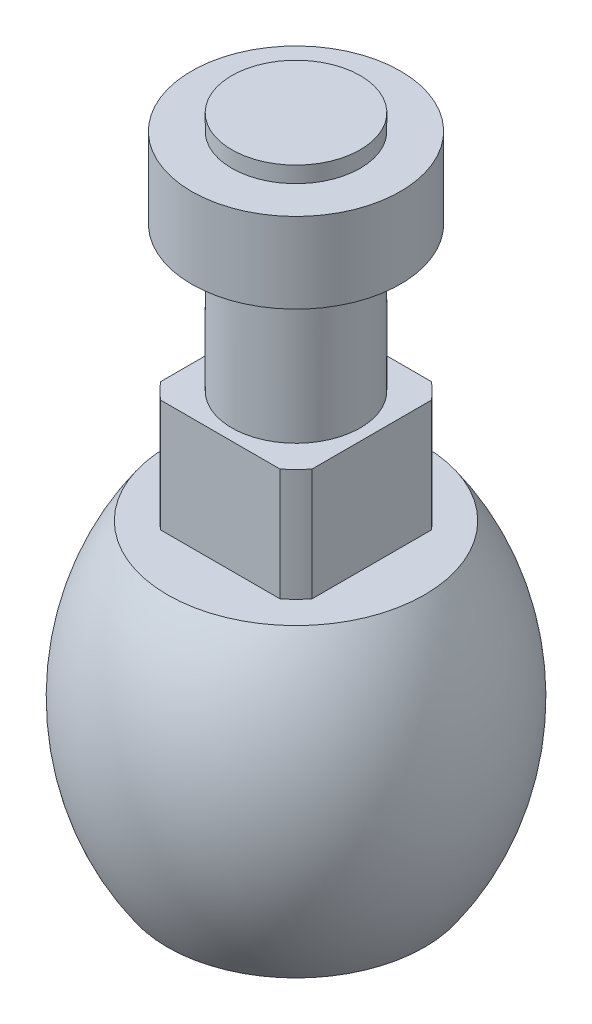
ISO-10303-21;
HEADER;
FILE_DESCRIPTION(('STEP AP214'),'2;1');
FILE_NAME('part.step','',(''),(''),'','','');
FILE_SCHEMA(('AUTOMOTIVE_DESIGN { 1 0 10303 214 1 1 1 1 }'));
ENDSEC;
DATA;
#1=APPLICATION_CONTEXT('core data for automotive mechanical design processes');
#2=APPLICATION_PROTOCOL_DEFINITION('international standard','automotive_design',2000,#1);
#3=PRODUCT_CONTEXT('',#1,'mechanical');
#4=PRODUCT('Part','Part','',(#3));
#5=PRODUCT_RELATED_PRODUCT_CATEGORY('part','',(#4));
#6=PRODUCT_DEFINITION_FORMATION('','',#4);
#7=PRODUCT_DEFINITION_CONTEXT('part definition',#1,'design');
#8=PRODUCT_DEFINITION('design','',#6,#7);
#9=PRODUCT_DEFINITION_SHAPE('','',#8);
#10=(LENGTH_UNIT() NAMED_UNIT(*) SI_UNIT(.MILLI.,.METRE.));
#11=(NAMED_UNIT(*) PLANE_ANGLE_UNIT() SI_UNIT($,.RADIAN.));
#12=(NAMED_UNIT(*) SI_UNIT($,.STERADIAN.) SOLID_ANGLE_UNIT());
#13=UNCERTAINTY_MEASURE_WITH_UNIT(LENGTH_MEASURE(1.E-05),#10,'distance_accuracy_value','');
#14=(GEOMETRIC_REPRESENTATION_CONTEXT(3) GLOBAL_UNCERTAINTY_ASSIGNED_CONTEXT((#13)) GLOBAL_UNIT_ASSIGNED_CONTEXT((#10,
#11,#12)) REPRESENTATION_CONTEXT('',''));
#15=CARTESIAN_POINT('',(0.,0.,0.));
#16=DIRECTION('',(0.,0.,1.));
#17=DIRECTION('',(1.,0.,0.));
#18=AXIS2_PLACEMENT_3D('',#15,#16,#17);
#19=CARTESIAN_POINT('',(0.,0.,0.));
#20=DIRECTION('',(0.,-1.,0.));
#21=DIRECTION('',(0.,0.,-1.));
#22=AXIS2_PLACEMENT_3D('',#19,#20,#21);
#23=CYLINDRICAL_SURFACE('',#22,4.);
#24=CARTESIAN_POINT('',(0.,26.,0.));
#25=DIRECTION('',(0.,-1.,0.));
#26=DIRECTION('',(0.,0.,-1.));
#27=AXIS2_PLACEMENT_3D('',#24,#25,#26);
#28=CIRCLE('',#27,4.);
#29=CARTESIAN_POINT('',(0.,26.,-4.));
#30=VERTEX_POINT('',#29);
#31=EDGE_CURVE('E127',#30,#30,#28,.T.);
#32=ORIENTED_EDGE('',*,*,#31,.F.);
#33=EDGE_LOOP('',(#32));
#34=FACE_BOUND('',#33,.T.);
#35=CARTESIAN_POINT('',(0.,35.,0.));
#36=DIRECTION('',(0.,1.,0.));
#37=DIRECTION('',(0.,0.,1.));
#38=AXIS2_PLACEMENT_3D('',#35,#36,#37);
#39=CIRCLE('',#38,4.);
#40=CARTESIAN_POINT('',(0.,35.,4.));
#41=VERTEX_POINT('',#40);
#42=EDGE_CURVE('E11',#41,#41,#39,.T.);
#43=ORIENTED_EDGE('',*,*,#42,.F.);
#44=EDGE_LOOP('',(#43));
#45=FACE_BOUND('',#44,.T.);
#46=ADVANCED_FACE('F35',(#34,#45),#23,.T.);
#47=CARTESIAN_POINT('',(0.,0.,0.));
#48=DIRECTION('',(0.,-1.,0.));
#49=DIRECTION('',(0.,0.,-1.));
#50=AXIS2_PLACEMENT_3D('',#47,#48,#49);
#51=CYLINDRICAL_SURFACE('',#50,6.);
#52=CARTESIAN_POINT('',(0.,26.,0.));
#53=DIRECTION('',(0.,-1.,0.));
#54=DIRECTION('',(0.,0.,-1.));
#55=AXIS2_PLACEMENT_3D('',#52,#53,#54);
#56=CIRCLE('',#55,6.);
#57=CARTESIAN_POINT('',(-4.71307488658818,26.,-3.71307488658818));
#58=VERTEX_POINT('',#57);
#59=CARTESIAN_POINT('',(-3.71307488658818,26.,-4.71307488658818));
#60=VERTEX_POINT('',#59);
#61=EDGE_CURVE('E130',#58,#60,#56,.T.);
#62=ORIENTED_EDGE('',*,*,#61,.T.);
#63=DIRECTION('',(0.,1.,0.));
#64=VECTOR('',#63,1.);
#65=CARTESIAN_POINT('',(-3.71307488658818,11.4631653394029,-4.71307488658818));
#66=LINE('',#65,#64);
#67=CARTESIAN_POINT('',(-3.71307488658818,19.,-4.71307488658818));
#68=VERTEX_POINT('',#67);
#69=EDGE_CURVE('E106',#68,#60,#66,.T.);
#70=ORIENTED_EDGE('',*,*,#69,.F.);
#71=CARTESIAN_POINT('',(0.,19.,0.));
#72=DIRECTION('',(0.,-1.,0.));
#73=DIRECTION('',(0.,0.,-1.));
#74=AXIS2_PLACEMENT_3D('',#71,#72,#73);
#75=CIRCLE('',#74,6.);
#76=CARTESIAN_POINT('',(-4.71307488658818,19.,-3.71307488658818));
#77=VERTEX_POINT('',#76);
#78=EDGE_CURVE('E141',#77,#68,#75,.T.);
#79=ORIENTED_EDGE('',*,*,#78,.F.);
#80=DIRECTION('',(0.,1.,0.));
#81=VECTOR('',#80,1.);
#82=CARTESIAN_POINT('',(-4.71307488658818,11.4631653394029,-3.71307488658818));
#83=LINE('',#82,#81);
#84=EDGE_CURVE('E153',#77,#58,#83,.T.);
#85=ORIENTED_EDGE('',*,*,#84,.T.);
#86=EDGE_LOOP('',(#62,#70,#79,#85));
#87=FACE_BOUND('',#86,.T.);
#88=ADVANCED_FACE('F214',(#87),#51,.T.);
#89=CARTESIAN_POINT('',(4.71307488658818,26.,3.71307488658818));
#90=VERTEX_POINT('',#89);
#91=CARTESIAN_POINT('',(3.71307488658818,26.,4.71307488658818));
#92=VERTEX_POINT('',#91);
#93=EDGE_CURVE('E128',#90,#92,#56,.T.);
#94=ORIENTED_EDGE('',*,*,#93,.T.);
#95=DIRECTION('',(0.,1.,0.));
#96=VECTOR('',#95,1.);
#97=CARTESIAN_POINT('',(3.71307488658818,11.4631653394029,4.71307488658818));
#98=LINE('',#97,#96);
#99=CARTESIAN_POINT('',(3.71307488658818,19.,4.71307488658818));
#100=VERTEX_POINT('',#99);
#101=EDGE_CURVE('E112',#100,#92,#98,.T.);
#102=ORIENTED_EDGE('',*,*,#101,.F.);
#103=CARTESIAN_POINT('',(4.71307488658818,19.,3.71307488658818));
#104=VERTEX_POINT('',#103);
#105=EDGE_CURVE('E140',#104,#100,#75,.T.);
#106=ORIENTED_EDGE('',*,*,#105,.F.);
#107=DIRECTION('',(0.,1.,0.));
#108=VECTOR('',#107,1.);
#109=CARTESIAN_POINT('',(4.71307488658818,11.4631653394029,3.71307488658818));
#110=LINE('',#109,#108);
#111=EDGE_CURVE('E162',#104,#90,#110,.T.);
#112=ORIENTED_EDGE('',*,*,#111,.T.);
#113=EDGE_LOOP('',(#94,#102,#106,#112));
#114=FACE_BOUND('',#113,.T.);
#115=ADVANCED_FACE('F221',(#114),#51,.T.);
#116=CARTESIAN_POINT('',(3.71307488658818,19.,-4.71307488658818));
#117=VERTEX_POINT('',#116);
#118=CARTESIAN_POINT('',(4.71307488658818,19.,-3.71307488658818));
#119=VERTEX_POINT('',#118);
#120=EDGE_CURVE('E120',#117,#119,#75,.T.);
#121=ORIENTED_EDGE('',*,*,#120,.F.);
#122=DIRECTION('',(0.,1.,0.));
#123=VECTOR('',#122,1.);
#124=CARTESIAN_POINT('',(3.71307488658818,11.4631653394029,-4.71307488658818));
#125=LINE('',#124,#123);
#126=CARTESIAN_POINT('',(3.71307488658818,26.,-4.71307488658818));
#127=VERTEX_POINT('',#126);
#128=EDGE_CURVE('E103',#117,#127,#125,.T.);
#129=ORIENTED_EDGE('',*,*,#128,.T.);
#130=CARTESIAN_POINT('',(4.71307488658818,26.,-3.71307488658818));
#131=VERTEX_POINT('',#130);
#132=EDGE_CURVE('E118',#127,#131,#56,.T.);
#133=ORIENTED_EDGE('',*,*,#132,.T.);
#134=DIRECTION('',(0.,1.,0.));
#135=VECTOR('',#134,1.);
#136=CARTESIAN_POINT('',(4.71307488658818,11.4631653394029,-3.71307488658818));
#137=LINE('',#136,#135);
#138=EDGE_CURVE('E159',#119,#131,#137,.T.);
#139=ORIENTED_EDGE('',*,*,#138,.F.);
#140=EDGE_LOOP('',(#121,#129,#133,#139));
#141=FACE_BOUND('',#140,.T.);
#142=ADVANCED_FACE('F116',(#141),#51,.T.);
#143=CARTESIAN_POINT('',(0.,9.5,0.));
#144=DIRECTION('',(0.,-1.,0.));
#145=DIRECTION('',(0.,0.,-1.));
#146=AXIS2_PLACEMENT_3D('',#143,#144,#145);
#147=DEGENERATE_TOROIDAL_SURFACE('',#146,5.54166666666666,16.5416666666667,.F.);
#148=CARTESIAN_POINT('',(0.,0.,0.));
#149=DIRECTION('',(0.,-1.,0.));
#150=DIRECTION('',(0.,0.,-1.));
#151=AXIS2_PLACEMENT_3D('',#148,#149,#150);
#152=CIRCLE('',#151,8.);
#153=CARTESIAN_POINT('',(0.,0.,-8.));
#154=VERTEX_POINT('',#153);
#155=EDGE_CURVE('E177',#154,#154,#152,.T.);
#156=ORIENTED_EDGE('',*,*,#155,.F.);
#157=EDGE_LOOP('',(#156));
#158=FACE_BOUND('',#157,.T.);
#159=CARTESIAN_POINT('',(0.,19.,0.));
#160=DIRECTION('',(0.,-1.,0.));
#161=DIRECTION('',(0.,0.,-1.));
#162=AXIS2_PLACEMENT_3D('',#159,#160,#161);
#163=CIRCLE('',#162,8.);
#164=CARTESIAN_POINT('',(0.,19.,-8.));
#165=VERTEX_POINT('',#164);
#166=EDGE_CURVE('E144',#165,#165,#163,.T.);
#167=ORIENTED_EDGE('',*,*,#166,.T.);
#168=EDGE_LOOP('',(#167));
#169=FACE_BOUND('',#168,.T.);
#170=ADVANCED_FACE('F37',(#158,#169),#147,.F.);
#171=CARTESIAN_POINT('',(-8.,0.,0.));
#172=DIRECTION('',(0.,1.,0.));
#173=DIRECTION('',(0.,0.,1.));
#174=AXIS2_PLACEMENT_3D('',#171,#172,#173);
#175=PLANE('',#174);
#176=CARTESIAN_POINT('',(0.,0.,0.));
#177=DIRECTION('',(0.,-1.,0.));
#178=DIRECTION('',(0.,0.,-1.));
#179=AXIS2_PLACEMENT_3D('',#176,#177,#178);
#180=CIRCLE('',#179,5.);
#181=CARTESIAN_POINT('',(0.,0.,-5.));
#182=VERTEX_POINT('',#181);
#183=EDGE_CURVE('E43',#182,#182,#180,.T.);
#184=ORIENTED_EDGE('',*,*,#183,.F.);
#185=EDGE_LOOP('',(#184));
#186=FACE_BOUND('',#185,.T.);
#187=ORIENTED_EDGE('',*,*,#155,.T.);
#188=EDGE_LOOP('',(#187));
#189=FACE_BOUND('',#188,.T.);
#190=ADVANCED_FACE('F228',(#186,#189),#175,.F.);
#191=CARTESIAN_POINT('',(-4.,26.,0.));
#192=DIRECTION('',(0.,-1.,0.));
#193=DIRECTION('',(0.,0.,-1.));
#194=AXIS2_PLACEMENT_3D('',#191,#192,#193);
#195=PLANE('',#194);
#196=ORIENTED_EDGE('',*,*,#132,.F.);
#197=DIRECTION('',(1.,0.,0.));
#198=VECTOR('',#197,1.);
#199=CARTESIAN_POINT('',(-3.71307488658818,26.,-4.71307488658818));
#200=LINE('',#199,#198);
#201=EDGE_CURVE('E100',#60,#127,#200,.T.);
#202=ORIENTED_EDGE('',*,*,#201,.F.);
#203=ORIENTED_EDGE('',*,*,#61,.F.);
#204=DIRECTION('',(0.,0.,-1.));
#205=VECTOR('',#204,1.);
#206=CARTESIAN_POINT('',(-4.71307488658818,26.,3.71307488658818));
#207=LINE('',#206,#205);
#208=CARTESIAN_POINT('',(-4.71307488658818,26.,3.71307488658818));
#209=VERTEX_POINT('',#208);
#210=EDGE_CURVE('E156',#209,#58,#207,.T.);
#211=ORIENTED_EDGE('',*,*,#210,.F.);
#212=CARTESIAN_POINT('',(-3.71307488658818,26.,4.71307488658818));
#213=VERTEX_POINT('',#212);
#214=EDGE_CURVE('E135',#213,#209,#56,.T.);
#215=ORIENTED_EDGE('',*,*,#214,.F.);
#216=DIRECTION('',(-1.,0.,0.));
#217=VECTOR('',#216,1.);
#218=CARTESIAN_POINT('',(3.71307488658818,26.,4.71307488658818));
#219=LINE('',#218,#217);
#220=EDGE_CURVE('E161',#92,#213,#219,.T.);
#221=ORIENTED_EDGE('',*,*,#220,.F.);
#222=ORIENTED_EDGE('',*,*,#93,.F.);
#223=DIRECTION('',(0.,0.,1.));
#224=VECTOR('',#223,1.);
#225=CARTESIAN_POINT('',(4.71307488658818,26.,-3.71307488658818));
#226=LINE('',#225,#224);
#227=EDGE_CURVE('E126',#131,#90,#226,.T.);
#228=ORIENTED_EDGE('',*,*,#227,.F.);
#229=EDGE_LOOP('',(#196,#202,#203,#211,#215,#221,#222,#228));
#230=FACE_BOUND('',#229,.T.);
#231=ORIENTED_EDGE('',*,*,#31,.T.);
#232=EDGE_LOOP('',(#231));
#233=FACE_BOUND('',#232,.T.);
#234=ADVANCED_FACE('F123',(#230,#233),#195,.F.);
#235=CARTESIAN_POINT('',(-3.71307488658818,19.,4.71307488658818));
#236=VERTEX_POINT('',#235);
#237=CARTESIAN_POINT('',(-4.71307488658818,19.,3.71307488658818));
#238=VERTEX_POINT('',#237);
#239=EDGE_CURVE('E142',#236,#238,#75,.T.);
#240=ORIENTED_EDGE('',*,*,#239,.F.);
#241=DIRECTION('',(0.,1.,0.));
#242=VECTOR('',#241,1.);
#243=CARTESIAN_POINT('',(-3.71307488658818,11.4631653394029,4.71307488658818));
#244=LINE('',#243,#242);
#245=EDGE_CURVE('E169',#236,#213,#244,.T.);
#246=ORIENTED_EDGE('',*,*,#245,.T.);
#247=ORIENTED_EDGE('',*,*,#214,.T.);
#248=DIRECTION('',(0.,1.,0.));
#249=VECTOR('',#248,1.);
#250=CARTESIAN_POINT('',(-4.71307488658818,11.4631653394029,3.71307488658818));
#251=LINE('',#250,#249);
#252=EDGE_CURVE('E151',#238,#209,#251,.T.);
#253=ORIENTED_EDGE('',*,*,#252,.F.);
#254=EDGE_LOOP('',(#240,#246,#247,#253));
#255=FACE_BOUND('',#254,.T.);
#256=ADVANCED_FACE('F223',(#255),#51,.T.);
#257=CARTESIAN_POINT('',(-6.,19.,0.));
#258=DIRECTION('',(0.,-1.,0.));
#259=DIRECTION('',(0.,0.,-1.));
#260=AXIS2_PLACEMENT_3D('',#257,#258,#259);
#261=PLANE('',#260);
#262=ORIENTED_EDGE('',*,*,#166,.F.);
#263=EDGE_LOOP('',(#262));
#264=FACE_BOUND('',#263,.T.);
#265=ORIENTED_EDGE('',*,*,#120,.T.);
#266=DIRECTION('',(0.,0.,1.));
#267=VECTOR('',#266,1.);
#268=CARTESIAN_POINT('',(4.71307488658818,19.,-3.71307488658818));
#269=LINE('',#268,#267);
#270=EDGE_CURVE('E165',#119,#104,#269,.T.);
#271=ORIENTED_EDGE('',*,*,#270,.T.);
#272=ORIENTED_EDGE('',*,*,#105,.T.);
#273=DIRECTION('',(-1.,0.,0.));
#274=VECTOR('',#273,1.);
#275=CARTESIAN_POINT('',(3.71307488658818,19.,4.71307488658818));
#276=LINE('',#275,#274);
#277=EDGE_CURVE('E56',#100,#236,#276,.T.);
#278=ORIENTED_EDGE('',*,*,#277,.T.);
#279=ORIENTED_EDGE('',*,*,#239,.T.);
#280=DIRECTION('',(0.,0.,-1.));
#281=VECTOR('',#280,1.);
#282=CARTESIAN_POINT('',(-4.71307488658818,19.,3.71307488658818));
#283=LINE('',#282,#281);
#284=EDGE_CURVE('E50',#238,#77,#283,.T.);
#285=ORIENTED_EDGE('',*,*,#284,.T.);
#286=ORIENTED_EDGE('',*,*,#78,.T.);
#287=DIRECTION('',(1.,0.,0.));
#288=VECTOR('',#287,1.);
#289=CARTESIAN_POINT('',(-3.71307488658818,19.,-4.71307488658818));
#290=LINE('',#289,#288);
#291=EDGE_CURVE('E111',#68,#117,#290,.T.);
#292=ORIENTED_EDGE('',*,*,#291,.T.);
#293=EDGE_LOOP('',(#265,#271,#272,#278,#279,#285,#286,#292));
#294=FACE_BOUND('',#293,.T.);
#295=ADVANCED_FACE('F231',(#264,#294),#261,.F.);
#296=CARTESIAN_POINT('',(-4.71307488658818,11.4631653394029,3.71307488658818));
#297=DIRECTION('',(1.,0.,0.));
#298=DIRECTION('',(0.,0.,-1.));
#299=AXIS2_PLACEMENT_3D('',#296,#297,#298);
#300=PLANE('',#299);
#301=ORIENTED_EDGE('',*,*,#252,.T.);
#302=ORIENTED_EDGE('',*,*,#210,.T.);
#303=ORIENTED_EDGE('',*,*,#84,.F.);
#304=ORIENTED_EDGE('',*,*,#284,.F.);
#305=EDGE_LOOP('',(#301,#302,#303,#304));
#306=FACE_BOUND('',#305,.T.);
#307=ADVANCED_FACE('F235',(#306),#300,.F.);
#308=CARTESIAN_POINT('',(4.71307488658818,11.4631653394029,-3.71307488658818));
#309=DIRECTION('',(-1.,0.,0.));
#310=DIRECTION('',(0.,0.,1.));
#311=AXIS2_PLACEMENT_3D('',#308,#309,#310);
#312=PLANE('',#311);
#313=ORIENTED_EDGE('',*,*,#138,.T.);
#314=ORIENTED_EDGE('',*,*,#227,.T.);
#315=ORIENTED_EDGE('',*,*,#111,.F.);
#316=ORIENTED_EDGE('',*,*,#270,.F.);
#317=EDGE_LOOP('',(#313,#314,#315,#316));
#318=FACE_BOUND('',#317,.T.);
#319=ADVANCED_FACE('F239',(#318),#312,.F.);
#320=CARTESIAN_POINT('',(3.71307488658818,11.4631653394029,4.71307488658818));
#321=DIRECTION('',(0.,0.,-1.));
#322=DIRECTION('',(-1.,0.,0.));
#323=AXIS2_PLACEMENT_3D('',#320,#321,#322);
#324=PLANE('',#323);
#325=ORIENTED_EDGE('',*,*,#101,.T.);
#326=ORIENTED_EDGE('',*,*,#220,.T.);
#327=ORIENTED_EDGE('',*,*,#245,.F.);
#328=ORIENTED_EDGE('',*,*,#277,.F.);
#329=EDGE_LOOP('',(#325,#326,#327,#328));
#330=FACE_BOUND('',#329,.T.);
#331=ADVANCED_FACE('F243',(#330),#324,.F.);
#332=CARTESIAN_POINT('',(-3.71307488658818,11.4631653394029,-4.71307488658818));
#333=DIRECTION('',(0.,0.,1.));
#334=DIRECTION('',(1.,0.,0.));
#335=AXIS2_PLACEMENT_3D('',#332,#333,#334);
#336=PLANE('',#335);
#337=ORIENTED_EDGE('',*,*,#69,.T.);
#338=ORIENTED_EDGE('',*,*,#201,.T.);
#339=ORIENTED_EDGE('',*,*,#128,.F.);
#340=ORIENTED_EDGE('',*,*,#291,.F.);
#341=EDGE_LOOP('',(#337,#338,#339,#340));
#342=FACE_BOUND('',#341,.T.);
#343=ADVANCED_FACE('F102',(#342),#336,.F.);
#344=CARTESIAN_POINT('',(0.,-1.,0.));
#345=DIRECTION('',(0.,1.,0.));
#346=DIRECTION('',(0.,0.,1.));
#347=AXIS2_PLACEMENT_3D('',#344,#345,#346);
#348=CYLINDRICAL_SURFACE('',#347,5.);
#349=CARTESIAN_POINT('',(0.,-1.,0.));
#350=DIRECTION('',(0.,-1.,0.));
#351=DIRECTION('',(0.,0.,-1.));
#352=AXIS2_PLACEMENT_3D('',#349,#350,#351);
#353=CIRCLE('',#352,5.);
#354=CARTESIAN_POINT('',(0.,-1.,-5.));
#355=VERTEX_POINT('',#354);
#356=EDGE_CURVE('E158',#355,#355,#353,.T.);
#357=ORIENTED_EDGE('',*,*,#356,.F.);
#358=EDGE_LOOP('',(#357));
#359=FACE_BOUND('',#358,.T.);
#360=ORIENTED_EDGE('',*,*,#183,.T.);
#361=EDGE_LOOP('',(#360));
#362=FACE_BOUND('',#361,.T.);
#363=ADVANCED_FACE('F250',(#359,#362),#348,.T.);
#364=CARTESIAN_POINT('',(0.,-1.,0.));
#365=DIRECTION('',(0.,-1.,0.));
#366=DIRECTION('',(0.,0.,-1.));
#367=AXIS2_PLACEMENT_3D('',#364,#365,#366);
#368=PLANE('',#367);
#369=ORIENTED_EDGE('',*,*,#356,.T.);
#370=EDGE_LOOP('',(#369));
#371=FACE_BOUND('',#370,.T.);
#372=ADVANCED_FACE('F253',(#371),#368,.T.);
#373=CARTESIAN_POINT('',(0.,35.,0.));
#374=DIRECTION('',(0.,1.,0.));
#375=DIRECTION('',(0.,0.,1.));
#376=AXIS2_PLACEMENT_3D('',#373,#374,#375);
#377=CYLINDRICAL_SURFACE('',#376,6.5);
#378=CARTESIAN_POINT('',(0.,35.,0.));
#379=DIRECTION('',(0.,1.,0.));
#380=DIRECTION('',(0.,0.,1.));
#381=AXIS2_PLACEMENT_3D('',#378,#379,#380);
#382=CIRCLE('',#381,6.5);
#383=CARTESIAN_POINT('',(0.,35.,6.5));
#384=VERTEX_POINT('',#383);
#385=EDGE_CURVE('E184',#384,#384,#382,.T.);
#386=ORIENTED_EDGE('',*,*,#385,.T.);
#387=EDGE_LOOP('',(#386));
#388=FACE_BOUND('',#387,.T.);
#389=CARTESIAN_POINT('',(0.,40.,0.));
#390=DIRECTION('',(0.,1.,0.));
#391=DIRECTION('',(0.,0.,1.));
#392=AXIS2_PLACEMENT_3D('',#389,#390,#391);
#393=CIRCLE('',#392,6.5);
#394=CARTESIAN_POINT('',(0.,40.,6.5));
#395=VERTEX_POINT('',#394);
#396=EDGE_CURVE('E181',#395,#395,#393,.T.);
#397=ORIENTED_EDGE('',*,*,#396,.F.);
#398=EDGE_LOOP('',(#397));
#399=FACE_BOUND('',#398,.T.);
#400=ADVANCED_FACE('F257',(#388,#399),#377,.T.);
#401=CARTESIAN_POINT('',(0.,35.,0.));
#402=DIRECTION('',(0.,1.,0.));
#403=DIRECTION('',(0.,0.,1.));
#404=AXIS2_PLACEMENT_3D('',#401,#402,#403);
#405=PLANE('',#404);
#406=ORIENTED_EDGE('',*,*,#42,.T.);
#407=EDGE_LOOP('',(#406));
#408=FACE_BOUND('',#407,.T.);
#409=ORIENTED_EDGE('',*,*,#385,.F.);
#410=EDGE_LOOP('',(#409));
#411=FACE_BOUND('',#410,.T.);
#412=ADVANCED_FACE('F210',(#408,#411),#405,.F.);
#413=CARTESIAN_POINT('',(0.,40.,0.));
#414=DIRECTION('',(0.,1.,0.));
#415=DIRECTION('',(0.,0.,1.));
#416=AXIS2_PLACEMENT_3D('',#413,#414,#415);
#417=PLANE('',#416);
#418=CARTESIAN_POINT('',(0.,40.,0.));
#419=DIRECTION('',(0.,1.,0.));
#420=DIRECTION('',(0.,0.,1.));
#421=AXIS2_PLACEMENT_3D('',#418,#419,#420);
#422=CIRCLE('',#421,4.);
#423=CARTESIAN_POINT('',(0.,40.,4.));
#424=VERTEX_POINT('',#423);
#425=EDGE_CURVE('E180',#424,#424,#422,.T.);
#426=ORIENTED_EDGE('',*,*,#425,.F.);
#427=EDGE_LOOP('',(#426));
#428=FACE_BOUND('',#427,.T.);
#429=ORIENTED_EDGE('',*,*,#396,.T.);
#430=EDGE_LOOP('',(#429));
#431=FACE_BOUND('',#430,.T.);
#432=ADVANCED_FACE('F201',(#428,#431),#417,.T.);
#433=CARTESIAN_POINT('',(0.,41.,0.));
#434=DIRECTION('',(0.,-1.,0.));
#435=DIRECTION('',(0.,0.,-1.));
#436=AXIS2_PLACEMENT_3D('',#433,#434,#435);
#437=PLANE('',#436);
#438=CARTESIAN_POINT('',(0.,41.,0.));
#439=DIRECTION('',(0.,-1.,0.));
#440=DIRECTION('',(0.,0.,-1.));
#441=AXIS2_PLACEMENT_3D('',#438,#439,#440);
#442=CIRCLE('',#441,4.);
#443=CARTESIAN_POINT('',(0.,41.,-4.));
#444=VERTEX_POINT('',#443);
#445=EDGE_CURVE('E132',#444,#444,#442,.T.);
#446=ORIENTED_EDGE('',*,*,#445,.F.);
#447=EDGE_LOOP('',(#446));
#448=FACE_BOUND('',#447,.T.);
#449=ADVANCED_FACE('F199',(#448),#437,.F.);
#450=ORIENTED_EDGE('',*,*,#425,.T.);
#451=EDGE_LOOP('',(#450));
#452=FACE_BOUND('',#451,.T.);
#453=ORIENTED_EDGE('',*,*,#445,.T.);
#454=EDGE_LOOP('',(#453));
#455=FACE_BOUND('',#454,.T.);
#456=ADVANCED_FACE('F197',(#452,#455),#23,.T.);
#457=CLOSED_SHELL('',(#46,#88,#115,#142,#170,#190,#234,#256,#295,#307,#319,#331,#343,#363,#372,
#400,#412,#432,#449,#456));
#458=MANIFOLD_SOLID_BREP('B2',#457);
#459=ADVANCED_BREP_SHAPE_REPRESENTATION('',(#18,#458),#14);
#460=SHAPE_DEFINITION_REPRESENTATION(#9,#459);
ENDSEC;
END-ISO-10303-21;
